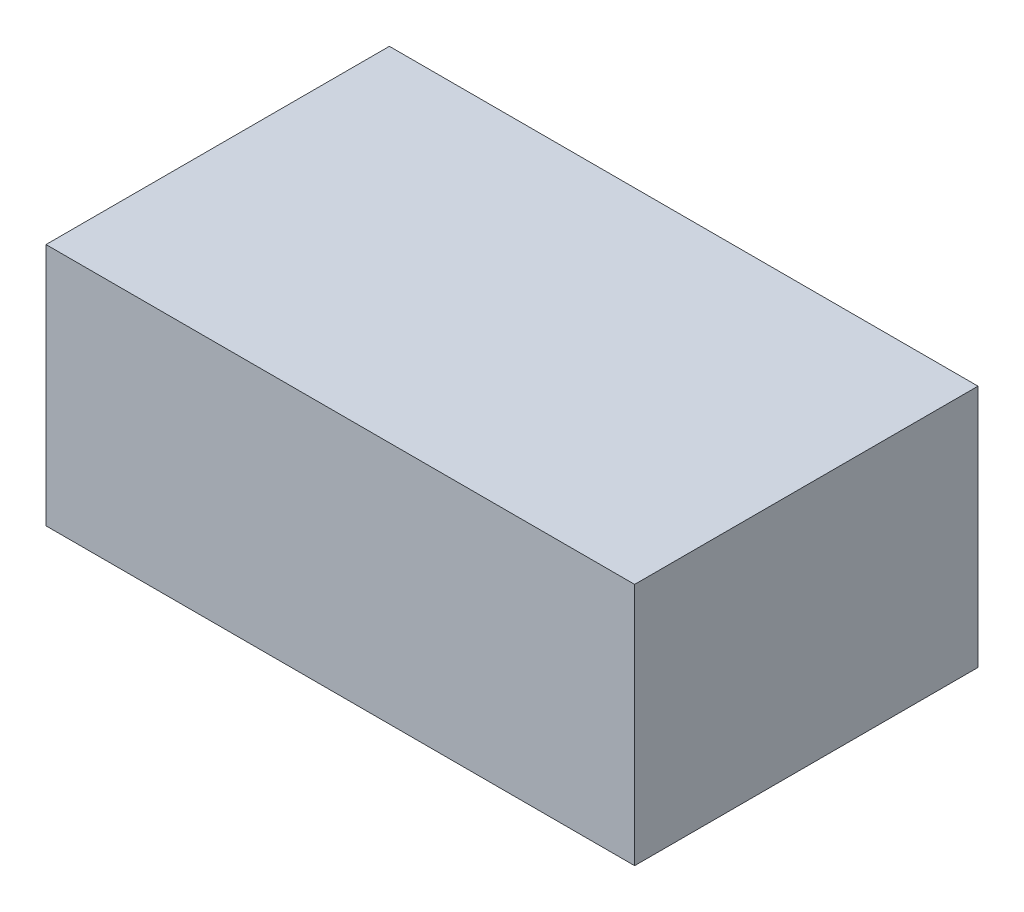
ISO-10303-21;
HEADER;
FILE_DESCRIPTION(('STEP AP214'),'2;1');
FILE_NAME('part.step','',(''),(''),'','','');
FILE_SCHEMA(('AUTOMOTIVE_DESIGN { 1 0 10303 214 1 1 1 1 }'));
ENDSEC;
DATA;
#1=APPLICATION_CONTEXT('core data for automotive mechanical design processes');
#2=APPLICATION_PROTOCOL_DEFINITION('international standard','automotive_design',2000,#1);
#3=PRODUCT_CONTEXT('',#1,'mechanical');
#4=PRODUCT('Part','Part','',(#3));
#5=PRODUCT_RELATED_PRODUCT_CATEGORY('part','',(#4));
#6=PRODUCT_DEFINITION_FORMATION('','',#4);
#7=PRODUCT_DEFINITION_CONTEXT('part definition',#1,'design');
#8=PRODUCT_DEFINITION('design','',#6,#7);
#9=PRODUCT_DEFINITION_SHAPE('','',#8);
#10=(LENGTH_UNIT() NAMED_UNIT(*) SI_UNIT(.MILLI.,.METRE.));
#11=(NAMED_UNIT(*) PLANE_ANGLE_UNIT() SI_UNIT($,.RADIAN.));
#12=(NAMED_UNIT(*) SI_UNIT($,.STERADIAN.) SOLID_ANGLE_UNIT());
#13=UNCERTAINTY_MEASURE_WITH_UNIT(LENGTH_MEASURE(1.E-05),#10,'distance_accuracy_value','');
#14=(GEOMETRIC_REPRESENTATION_CONTEXT(3) GLOBAL_UNCERTAINTY_ASSIGNED_CONTEXT((#13)) GLOBAL_UNIT_ASSIGNED_CONTEXT((#10,
#11,#12)) REPRESENTATION_CONTEXT('',''));
#15=CARTESIAN_POINT('',(0.,0.,0.));
#16=DIRECTION('',(0.,0.,1.));
#17=DIRECTION('',(1.,0.,0.));
#18=AXIS2_PLACEMENT_3D('',#15,#16,#17);
#19=CARTESIAN_POINT('',(-914.4,756.92,533.4));
#20=DIRECTION('',(1.,0.,0.));
#21=DIRECTION('',(0.,0.,-1.));
#22=AXIS2_PLACEMENT_3D('',#19,#20,#21);
#23=PLANE('',#22);
#24=DIRECTION('',(0.,0.,1.));
#25=VECTOR('',#24,1.);
#26=CARTESIAN_POINT('',(-914.4,0.,533.4));
#27=LINE('',#26,#25);
#28=CARTESIAN_POINT('',(-914.4,0.,-533.4));
#29=VERTEX_POINT('',#28);
#30=CARTESIAN_POINT('',(-914.4,0.,533.4));
#31=VERTEX_POINT('',#30);
#32=EDGE_CURVE('E98',#29,#31,#27,.T.);
#33=ORIENTED_EDGE('',*,*,#32,.T.);
#34=DIRECTION('',(0.,-1.,0.));
#35=VECTOR('',#34,1.);
#36=CARTESIAN_POINT('',(-914.4,756.92,533.4));
#37=LINE('',#36,#35);
#38=CARTESIAN_POINT('',(-914.4,756.92,533.4));
#39=VERTEX_POINT('',#38);
#40=EDGE_CURVE('E11',#39,#31,#37,.T.);
#41=ORIENTED_EDGE('',*,*,#40,.F.);
#42=DIRECTION('',(0.,0.,1.));
#43=VECTOR('',#42,1.);
#44=CARTESIAN_POINT('',(-914.4,756.92,533.4));
#45=LINE('',#44,#43);
#46=CARTESIAN_POINT('',(-914.4,756.92,-533.4));
#47=VERTEX_POINT('',#46);
#48=EDGE_CURVE('E86',#47,#39,#45,.T.);
#49=ORIENTED_EDGE('',*,*,#48,.F.);
#50=DIRECTION('',(0.,-1.,0.));
#51=VECTOR('',#50,1.);
#52=CARTESIAN_POINT('',(-914.4,756.92,-533.4));
#53=LINE('',#52,#51);
#54=EDGE_CURVE('E94',#47,#29,#53,.T.);
#55=ORIENTED_EDGE('',*,*,#54,.T.);
#56=EDGE_LOOP('',(#33,#41,#49,#55));
#57=FACE_BOUND('',#56,.T.);
#58=ADVANCED_FACE('F35',(#57),#23,.F.);
#59=CARTESIAN_POINT('',(914.4,756.92,533.4));
#60=DIRECTION('',(0.,0.,-1.));
#61=DIRECTION('',(-1.,0.,0.));
#62=AXIS2_PLACEMENT_3D('',#59,#60,#61);
#63=PLANE('',#62);
#64=DIRECTION('',(1.,0.,0.));
#65=VECTOR('',#64,1.);
#66=CARTESIAN_POINT('',(914.4,0.,533.4));
#67=LINE('',#66,#65);
#68=CARTESIAN_POINT('',(914.4,0.,533.4));
#69=VERTEX_POINT('',#68);
#70=EDGE_CURVE('E90',#31,#69,#67,.T.);
#71=ORIENTED_EDGE('',*,*,#70,.T.);
#72=DIRECTION('',(0.,-1.,0.));
#73=VECTOR('',#72,1.);
#74=CARTESIAN_POINT('',(914.4,756.92,533.4));
#75=LINE('',#74,#73);
#76=CARTESIAN_POINT('',(914.4,756.92,533.4));
#77=VERTEX_POINT('',#76);
#78=EDGE_CURVE('E43',#77,#69,#75,.T.);
#79=ORIENTED_EDGE('',*,*,#78,.F.);
#80=DIRECTION('',(1.,0.,0.));
#81=VECTOR('',#80,1.);
#82=CARTESIAN_POINT('',(914.4,756.92,533.4));
#83=LINE('',#82,#81);
#84=EDGE_CURVE('E81',#39,#77,#83,.T.);
#85=ORIENTED_EDGE('',*,*,#84,.F.);
#86=ORIENTED_EDGE('',*,*,#40,.T.);
#87=EDGE_LOOP('',(#71,#79,#85,#86));
#88=FACE_BOUND('',#87,.T.);
#89=ADVANCED_FACE('F89',(#88),#63,.F.);
#90=CARTESIAN_POINT('',(914.4,756.92,533.4));
#91=DIRECTION('',(-1.,0.,0.));
#92=DIRECTION('',(0.,0.,1.));
#93=AXIS2_PLACEMENT_3D('',#90,#91,#92);
#94=PLANE('',#93);
#95=DIRECTION('',(0.,0.,-1.));
#96=VECTOR('',#95,1.);
#97=CARTESIAN_POINT('',(914.4,0.,533.4));
#98=LINE('',#97,#96);
#99=CARTESIAN_POINT('',(914.4,0.,-533.4));
#100=VERTEX_POINT('',#99);
#101=EDGE_CURVE('E68',#69,#100,#98,.T.);
#102=ORIENTED_EDGE('',*,*,#101,.T.);
#103=DIRECTION('',(0.,-1.,0.));
#104=VECTOR('',#103,1.);
#105=CARTESIAN_POINT('',(914.4,756.92,-533.4));
#106=LINE('',#105,#104);
#107=CARTESIAN_POINT('',(914.4,756.92,-533.4));
#108=VERTEX_POINT('',#107);
#109=EDGE_CURVE('E91',#108,#100,#106,.T.);
#110=ORIENTED_EDGE('',*,*,#109,.F.);
#111=DIRECTION('',(0.,0.,-1.));
#112=VECTOR('',#111,1.);
#113=CARTESIAN_POINT('',(914.4,756.92,533.4));
#114=LINE('',#113,#112);
#115=EDGE_CURVE('E84',#77,#108,#114,.T.);
#116=ORIENTED_EDGE('',*,*,#115,.F.);
#117=ORIENTED_EDGE('',*,*,#78,.T.);
#118=EDGE_LOOP('',(#102,#110,#116,#117));
#119=FACE_BOUND('',#118,.T.);
#120=ADVANCED_FACE('F92',(#119),#94,.F.);
#121=CARTESIAN_POINT('',(914.4,756.92,-533.4));
#122=DIRECTION('',(0.,0.,1.));
#123=DIRECTION('',(1.,0.,0.));
#124=AXIS2_PLACEMENT_3D('',#121,#122,#123);
#125=PLANE('',#124);
#126=DIRECTION('',(-1.,0.,0.));
#127=VECTOR('',#126,1.);
#128=CARTESIAN_POINT('',(914.4,0.,-533.4));
#129=LINE('',#128,#127);
#130=EDGE_CURVE('E74',#100,#29,#129,.T.);
#131=ORIENTED_EDGE('',*,*,#130,.T.);
#132=ORIENTED_EDGE('',*,*,#54,.F.);
#133=DIRECTION('',(-1.,0.,0.));
#134=VECTOR('',#133,1.);
#135=CARTESIAN_POINT('',(914.4,756.92,-533.4));
#136=LINE('',#135,#134);
#137=EDGE_CURVE('E51',#108,#47,#136,.T.);
#138=ORIENTED_EDGE('',*,*,#137,.F.);
#139=ORIENTED_EDGE('',*,*,#109,.T.);
#140=EDGE_LOOP('',(#131,#132,#138,#139));
#141=FACE_BOUND('',#140,.T.);
#142=ADVANCED_FACE('F105',(#141),#125,.F.);
#143=CARTESIAN_POINT('',(0.,756.92,0.));
#144=DIRECTION('',(0.,1.,0.));
#145=DIRECTION('',(0.,0.,1.));
#146=AXIS2_PLACEMENT_3D('',#143,#144,#145);
#147=PLANE('',#146);
#148=ORIENTED_EDGE('',*,*,#48,.T.);
#149=ORIENTED_EDGE('',*,*,#84,.T.);
#150=ORIENTED_EDGE('',*,*,#115,.T.);
#151=ORIENTED_EDGE('',*,*,#137,.T.);
#152=EDGE_LOOP('',(#148,#149,#150,#151));
#153=FACE_BOUND('',#152,.T.);
#154=ADVANCED_FACE('F82',(#153),#147,.T.);
#155=CARTESIAN_POINT('',(0.,0.,0.));
#156=DIRECTION('',(0.,1.,0.));
#157=DIRECTION('',(0.,0.,1.));
#158=AXIS2_PLACEMENT_3D('',#155,#156,#157);
#159=PLANE('',#158);
#160=ORIENTED_EDGE('',*,*,#32,.F.);
#161=ORIENTED_EDGE('',*,*,#130,.F.);
#162=ORIENTED_EDGE('',*,*,#101,.F.);
#163=ORIENTED_EDGE('',*,*,#70,.F.);
#164=EDGE_LOOP('',(#160,#161,#162,#163));
#165=FACE_BOUND('',#164,.T.);
#166=ADVANCED_FACE('F108',(#165),#159,.F.);
#167=CLOSED_SHELL('',(#58,#89,#120,#142,#154,#166));
#168=MANIFOLD_SOLID_BREP('B2',#167);
#169=ADVANCED_BREP_SHAPE_REPRESENTATION('',(#18,#168),#14);
#170=SHAPE_DEFINITION_REPRESENTATION(#9,#169);
ENDSEC;
END-ISO-10303-21;
